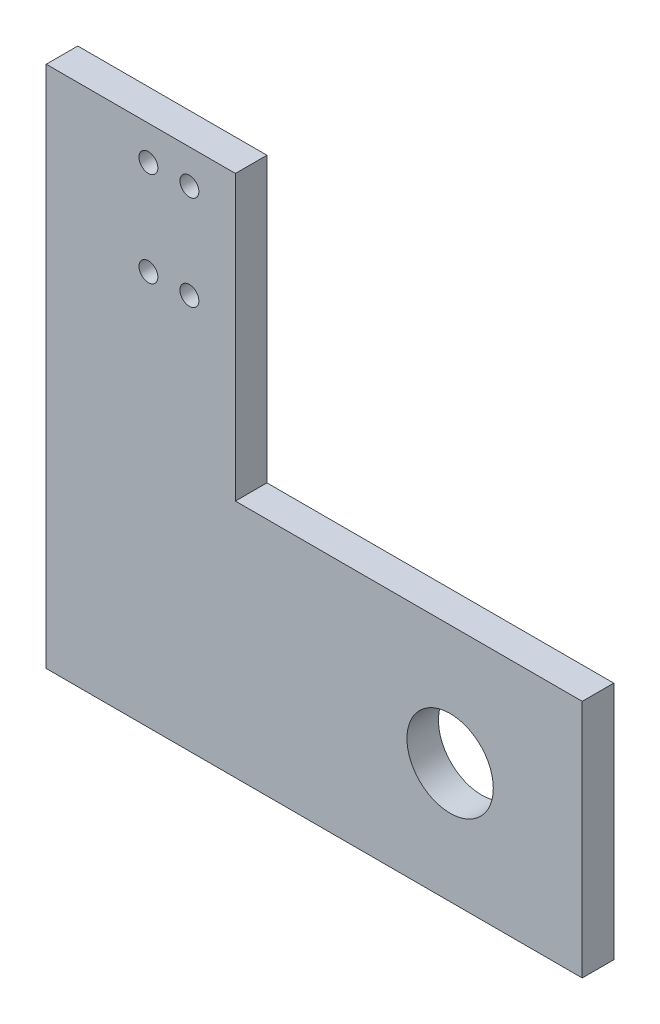
ISO-10303-21;
HEADER;
FILE_DESCRIPTION(('STEP AP214'),'2;1');
FILE_NAME('part.step','',(''),(''),'','','');
FILE_SCHEMA(('AUTOMOTIVE_DESIGN { 1 0 10303 214 1 1 1 1 }'));
ENDSEC;
DATA;
#1=APPLICATION_CONTEXT('core data for automotive mechanical design processes');
#2=APPLICATION_PROTOCOL_DEFINITION('international standard','automotive_design',2000,#1);
#3=PRODUCT_CONTEXT('',#1,'mechanical');
#4=PRODUCT('Part','Part','',(#3));
#5=PRODUCT_RELATED_PRODUCT_CATEGORY('part','',(#4));
#6=PRODUCT_DEFINITION_FORMATION('','',#4);
#7=PRODUCT_DEFINITION_CONTEXT('part definition',#1,'design');
#8=PRODUCT_DEFINITION('design','',#6,#7);
#9=PRODUCT_DEFINITION_SHAPE('','',#8);
#10=(LENGTH_UNIT() NAMED_UNIT(*) SI_UNIT(.MILLI.,.METRE.));
#11=(NAMED_UNIT(*) PLANE_ANGLE_UNIT() SI_UNIT($,.RADIAN.));
#12=(NAMED_UNIT(*) SI_UNIT($,.STERADIAN.) SOLID_ANGLE_UNIT());
#13=UNCERTAINTY_MEASURE_WITH_UNIT(LENGTH_MEASURE(1.E-05),#10,'distance_accuracy_value','');
#14=(GEOMETRIC_REPRESENTATION_CONTEXT(3) GLOBAL_UNCERTAINTY_ASSIGNED_CONTEXT((#13)) GLOBAL_UNIT_ASSIGNED_CONTEXT((#10,
#11,#12)) REPRESENTATION_CONTEXT('',''));
#15=CARTESIAN_POINT('',(0.,0.,0.));
#16=DIRECTION('',(0.,0.,1.));
#17=DIRECTION('',(1.,0.,0.));
#18=AXIS2_PLACEMENT_3D('',#15,#16,#17);
#19=CARTESIAN_POINT('',(0.,0.,5.));
#20=DIRECTION('',(0.,0.,-1.));
#21=DIRECTION('',(-1.,0.,0.));
#22=AXIS2_PLACEMENT_3D('',#19,#20,#21);
#23=PLANE('',#22);
#24=DIRECTION('',(-1.,0.,0.));
#25=VECTOR('',#24,1.);
#26=CARTESIAN_POINT('',(2345.47122728018,4698.97617233095,5.));
#27=LINE('',#26,#25);
#28=CARTESIAN_POINT('',(2400.47122728018,4698.97617233095,5.));
#29=VERTEX_POINT('',#28);
#30=CARTESIAN_POINT('',(2345.47122728018,4698.97617233095,5.));
#31=VERTEX_POINT('',#30);
#32=EDGE_CURVE('E131',#29,#31,#27,.T.);
#33=ORIENTED_EDGE('',*,*,#32,.T.);
#34=DIRECTION('',(0.,1.,0.));
#35=VECTOR('',#34,1.);
#36=CARTESIAN_POINT('',(2345.47122728018,4698.97617233095,5.));
#37=LINE('',#36,#35);
#38=CARTESIAN_POINT('',(2345.47122728018,4743.97617233095,5.));
#39=VERTEX_POINT('',#38);
#40=EDGE_CURVE('E89',#31,#39,#37,.T.);
#41=ORIENTED_EDGE('',*,*,#40,.T.);
#42=DIRECTION('',(-1.,0.,0.));
#43=VECTOR('',#42,1.);
#44=CARTESIAN_POINT('',(2345.47122728018,4743.97617233095,5.));
#45=LINE('',#44,#43);
#46=CARTESIAN_POINT('',(2315.47122728018,4743.97617233095,5.));
#47=VERTEX_POINT('',#46);
#48=EDGE_CURVE('E102',#39,#47,#45,.T.);
#49=ORIENTED_EDGE('',*,*,#48,.T.);
#50=DIRECTION('',(0.,-1.,0.));
#51=VECTOR('',#50,1.);
#52=CARTESIAN_POINT('',(2315.47122728018,4660.97617233095,5.));
#53=LINE('',#52,#51);
#54=CARTESIAN_POINT('',(2315.47122728018,4660.97617233095,5.));
#55=VERTEX_POINT('',#54);
#56=EDGE_CURVE('E96',#47,#55,#53,.T.);
#57=ORIENTED_EDGE('',*,*,#56,.T.);
#58=DIRECTION('',(1.,0.,0.));
#59=VECTOR('',#58,1.);
#60=CARTESIAN_POINT('',(2315.47122728018,4660.97617233095,5.));
#61=LINE('',#60,#59);
#62=CARTESIAN_POINT('',(2400.47122728018,4660.97617233095,5.));
#63=VERTEX_POINT('',#62);
#64=EDGE_CURVE('E100',#55,#63,#61,.T.);
#65=ORIENTED_EDGE('',*,*,#64,.T.);
#66=DIRECTION('',(0.,1.,0.));
#67=VECTOR('',#66,1.);
#68=CARTESIAN_POINT('',(2400.47122728018,4698.97617233095,5.));
#69=LINE('',#68,#67);
#70=EDGE_CURVE('E52',#63,#29,#69,.T.);
#71=ORIENTED_EDGE('',*,*,#70,.T.);
#72=EDGE_LOOP('',(#33,#41,#49,#57,#65,#71));
#73=FACE_BOUND('',#72,.T.);
#74=CARTESIAN_POINT('',(2338.17240907653,4738.57617233095,5.));
#75=DIRECTION('',(0.,0.,1.));
#76=DIRECTION('',(1.,0.,0.));
#77=AXIS2_PLACEMENT_3D('',#74,#75,#76);
#78=CIRCLE('',#77,1.50000000000006);
#79=CARTESIAN_POINT('',(2339.67240907653,4738.57617233095,5.));
#80=VERTEX_POINT('',#79);
#81=EDGE_CURVE('E124',#80,#80,#78,.T.);
#82=ORIENTED_EDGE('',*,*,#81,.F.);
#83=EDGE_LOOP('',(#82));
#84=FACE_BOUND('',#83,.T.);
#85=CARTESIAN_POINT('',(2338.17240907653,4723.57617233095,5.));
#86=DIRECTION('',(0.,0.,1.));
#87=DIRECTION('',(1.,0.,0.));
#88=AXIS2_PLACEMENT_3D('',#85,#86,#87);
#89=CIRCLE('',#88,1.50000000000006);
#90=CARTESIAN_POINT('',(2339.67240907653,4723.57617233095,5.));
#91=VERTEX_POINT('',#90);
#92=EDGE_CURVE('E205',#91,#91,#89,.T.);
#93=ORIENTED_EDGE('',*,*,#92,.F.);
#94=EDGE_LOOP('',(#93));
#95=FACE_BOUND('',#94,.T.);
#96=CARTESIAN_POINT('',(2331.67240907653,4738.57617233095,5.));
#97=DIRECTION('',(0.,0.,1.));
#98=DIRECTION('',(1.,0.,0.));
#99=AXIS2_PLACEMENT_3D('',#96,#97,#98);
#100=CIRCLE('',#99,1.50000000000006);
#101=CARTESIAN_POINT('',(2333.17240907653,4738.57617233095,5.));
#102=VERTEX_POINT('',#101);
#103=EDGE_CURVE('E199',#102,#102,#100,.T.);
#104=ORIENTED_EDGE('',*,*,#103,.F.);
#105=EDGE_LOOP('',(#104));
#106=FACE_BOUND('',#105,.T.);
#107=CARTESIAN_POINT('',(2331.67240907653,4723.57617233095,5.));
#108=DIRECTION('',(0.,0.,1.));
#109=DIRECTION('',(1.,0.,0.));
#110=AXIS2_PLACEMENT_3D('',#107,#108,#109);
#111=CIRCLE('',#110,1.50000000000006);
#112=CARTESIAN_POINT('',(2333.17240907653,4723.57617233095,5.));
#113=VERTEX_POINT('',#112);
#114=EDGE_CURVE('E193',#113,#113,#111,.T.);
#115=ORIENTED_EDGE('',*,*,#114,.F.);
#116=EDGE_LOOP('',(#115));
#117=FACE_BOUND('',#116,.T.);
#118=CARTESIAN_POINT('',(2379.5182473387,4679.97617233095,5.));
#119=DIRECTION('',(0.,0.,1.));
#120=DIRECTION('',(1.,0.,0.));
#121=AXIS2_PLACEMENT_3D('',#118,#119,#120);
#122=CIRCLE('',#121,6.85000000000002);
#123=CARTESIAN_POINT('',(2386.3682473387,4679.97617233095,5.));
#124=VERTEX_POINT('',#123);
#125=EDGE_CURVE('E184',#124,#124,#122,.T.);
#126=ORIENTED_EDGE('',*,*,#125,.F.);
#127=EDGE_LOOP('',(#126));
#128=FACE_BOUND('',#127,.T.);
#129=ADVANCED_FACE('F35',(#73,#84,#95,#106,#117,#128),#23,.F.);
#130=CARTESIAN_POINT('',(0.,0.,0.));
#131=DIRECTION('',(0.,0.,-1.));
#132=DIRECTION('',(-1.,0.,0.));
#133=AXIS2_PLACEMENT_3D('',#130,#131,#132);
#134=PLANE('',#133);
#135=CARTESIAN_POINT('',(2331.67240907653,4723.57617233095,0.));
#136=DIRECTION('',(0.,0.,1.));
#137=DIRECTION('',(1.,0.,0.));
#138=AXIS2_PLACEMENT_3D('',#135,#136,#137);
#139=CIRCLE('',#138,1.50000000000006);
#140=CARTESIAN_POINT('',(2333.17240907653,4723.57617233095,0.));
#141=VERTEX_POINT('',#140);
#142=EDGE_CURVE('E190',#141,#141,#139,.T.);
#143=ORIENTED_EDGE('',*,*,#142,.T.);
#144=EDGE_LOOP('',(#143));
#145=FACE_BOUND('',#144,.T.);
#146=CARTESIAN_POINT('',(2338.17240907653,4723.57617233095,0.));
#147=DIRECTION('',(0.,0.,1.));
#148=DIRECTION('',(1.,0.,0.));
#149=AXIS2_PLACEMENT_3D('',#146,#147,#148);
#150=CIRCLE('',#149,1.50000000000006);
#151=CARTESIAN_POINT('',(2339.67240907653,4723.57617233095,0.));
#152=VERTEX_POINT('',#151);
#153=EDGE_CURVE('E202',#152,#152,#150,.T.);
#154=ORIENTED_EDGE('',*,*,#153,.T.);
#155=EDGE_LOOP('',(#154));
#156=FACE_BOUND('',#155,.T.);
#157=DIRECTION('',(-1.,0.,0.));
#158=VECTOR('',#157,1.);
#159=CARTESIAN_POINT('',(2345.47122728018,4698.97617233095,0.));
#160=LINE('',#159,#158);
#161=CARTESIAN_POINT('',(2400.47122728018,4698.97617233095,0.));
#162=VERTEX_POINT('',#161);
#163=CARTESIAN_POINT('',(2345.47122728018,4698.97617233095,0.));
#164=VERTEX_POINT('',#163);
#165=EDGE_CURVE('E120',#162,#164,#160,.T.);
#166=ORIENTED_EDGE('',*,*,#165,.F.);
#167=DIRECTION('',(0.,1.,0.));
#168=VECTOR('',#167,1.);
#169=CARTESIAN_POINT('',(2400.47122728018,4698.97617233095,0.));
#170=LINE('',#169,#168);
#171=CARTESIAN_POINT('',(2400.47122728018,4660.97617233095,0.));
#172=VERTEX_POINT('',#171);
#173=EDGE_CURVE('E81',#172,#162,#170,.T.);
#174=ORIENTED_EDGE('',*,*,#173,.F.);
#175=DIRECTION('',(1.,0.,0.));
#176=VECTOR('',#175,1.);
#177=CARTESIAN_POINT('',(2315.47122728018,4660.97617233095,0.));
#178=LINE('',#177,#176);
#179=CARTESIAN_POINT('',(2315.47122728018,4660.97617233095,0.));
#180=VERTEX_POINT('',#179);
#181=EDGE_CURVE('E75',#180,#172,#178,.T.);
#182=ORIENTED_EDGE('',*,*,#181,.F.);
#183=DIRECTION('',(0.,-1.,0.));
#184=VECTOR('',#183,1.);
#185=CARTESIAN_POINT('',(2315.47122728018,4660.97617233095,0.));
#186=LINE('',#185,#184);
#187=CARTESIAN_POINT('',(2315.47122728018,4743.97617233095,0.));
#188=VERTEX_POINT('',#187);
#189=EDGE_CURVE('E110',#188,#180,#186,.T.);
#190=ORIENTED_EDGE('',*,*,#189,.F.);
#191=DIRECTION('',(-1.,0.,0.));
#192=VECTOR('',#191,1.);
#193=CARTESIAN_POINT('',(2345.47122728018,4743.97617233095,0.));
#194=LINE('',#193,#192);
#195=CARTESIAN_POINT('',(2345.47122728018,4743.97617233095,0.));
#196=VERTEX_POINT('',#195);
#197=EDGE_CURVE('E126',#196,#188,#194,.T.);
#198=ORIENTED_EDGE('',*,*,#197,.F.);
#199=DIRECTION('',(0.,1.,0.));
#200=VECTOR('',#199,1.);
#201=CARTESIAN_POINT('',(2345.47122728018,4698.97617233095,0.));
#202=LINE('',#201,#200);
#203=EDGE_CURVE('E123',#164,#196,#202,.T.);
#204=ORIENTED_EDGE('',*,*,#203,.F.);
#205=EDGE_LOOP('',(#166,#174,#182,#190,#198,#204));
#206=FACE_BOUND('',#205,.T.);
#207=CARTESIAN_POINT('',(2338.17240907653,4738.57617233095,0.));
#208=DIRECTION('',(0.,0.,1.));
#209=DIRECTION('',(1.,0.,0.));
#210=AXIS2_PLACEMENT_3D('',#207,#208,#209);
#211=CIRCLE('',#210,1.50000000000006);
#212=CARTESIAN_POINT('',(2339.67240907653,4738.57617233095,0.));
#213=VERTEX_POINT('',#212);
#214=EDGE_CURVE('E208',#213,#213,#211,.T.);
#215=ORIENTED_EDGE('',*,*,#214,.T.);
#216=EDGE_LOOP('',(#215));
#217=FACE_BOUND('',#216,.T.);
#218=CARTESIAN_POINT('',(2331.67240907653,4738.57617233095,0.));
#219=DIRECTION('',(0.,0.,1.));
#220=DIRECTION('',(1.,0.,0.));
#221=AXIS2_PLACEMENT_3D('',#218,#219,#220);
#222=CIRCLE('',#221,1.50000000000006);
#223=CARTESIAN_POINT('',(2333.17240907653,4738.57617233095,0.));
#224=VERTEX_POINT('',#223);
#225=EDGE_CURVE('E196',#224,#224,#222,.T.);
#226=ORIENTED_EDGE('',*,*,#225,.T.);
#227=EDGE_LOOP('',(#226));
#228=FACE_BOUND('',#227,.T.);
#229=CARTESIAN_POINT('',(2379.5182473387,4679.97617233095,0.));
#230=DIRECTION('',(0.,0.,1.));
#231=DIRECTION('',(1.,0.,0.));
#232=AXIS2_PLACEMENT_3D('',#229,#230,#231);
#233=CIRCLE('',#232,6.85000000000002);
#234=CARTESIAN_POINT('',(2386.3682473387,4679.97617233095,0.));
#235=VERTEX_POINT('',#234);
#236=EDGE_CURVE('E187',#235,#235,#233,.T.);
#237=ORIENTED_EDGE('',*,*,#236,.T.);
#238=EDGE_LOOP('',(#237));
#239=FACE_BOUND('',#238,.T.);
#240=ADVANCED_FACE('F140',(#145,#156,#206,#217,#228,#239),#134,.T.);
#241=CARTESIAN_POINT('',(2345.47122728018,4698.97617233095,5.));
#242=DIRECTION('',(0.,-1.,0.));
#243=DIRECTION('',(0.,0.,-1.));
#244=AXIS2_PLACEMENT_3D('',#241,#242,#243);
#245=PLANE('',#244);
#246=ORIENTED_EDGE('',*,*,#165,.T.);
#247=DIRECTION('',(0.,0.,-1.));
#248=VECTOR('',#247,1.);
#249=CARTESIAN_POINT('',(2345.47122728018,4698.97617233095,5.));
#250=LINE('',#249,#248);
#251=EDGE_CURVE('E11',#31,#164,#250,.T.);
#252=ORIENTED_EDGE('',*,*,#251,.F.);
#253=ORIENTED_EDGE('',*,*,#32,.F.);
#254=DIRECTION('',(0.,0.,-1.));
#255=VECTOR('',#254,1.);
#256=CARTESIAN_POINT('',(2400.47122728018,4698.97617233095,5.));
#257=LINE('',#256,#255);
#258=EDGE_CURVE('E116',#29,#162,#257,.T.);
#259=ORIENTED_EDGE('',*,*,#258,.T.);
#260=EDGE_LOOP('',(#246,#252,#253,#259));
#261=FACE_BOUND('',#260,.T.);
#262=ADVANCED_FACE('F37',(#261),#245,.F.);
#263=CARTESIAN_POINT('',(2345.47122728018,4698.97617233095,5.));
#264=DIRECTION('',(-1.,0.,0.));
#265=DIRECTION('',(0.,0.,1.));
#266=AXIS2_PLACEMENT_3D('',#263,#264,#265);
#267=PLANE('',#266);
#268=ORIENTED_EDGE('',*,*,#203,.T.);
#269=DIRECTION('',(0.,0.,-1.));
#270=VECTOR('',#269,1.);
#271=CARTESIAN_POINT('',(2345.47122728018,4743.97617233095,5.));
#272=LINE('',#271,#270);
#273=EDGE_CURVE('E44',#39,#196,#272,.T.);
#274=ORIENTED_EDGE('',*,*,#273,.F.);
#275=ORIENTED_EDGE('',*,*,#40,.F.);
#276=ORIENTED_EDGE('',*,*,#251,.T.);
#277=EDGE_LOOP('',(#268,#274,#275,#276));
#278=FACE_BOUND('',#277,.T.);
#279=ADVANCED_FACE('F277',(#278),#267,.F.);
#280=CARTESIAN_POINT('',(2345.47122728018,4743.97617233095,5.));
#281=DIRECTION('',(0.,-1.,0.));
#282=DIRECTION('',(0.,0.,-1.));
#283=AXIS2_PLACEMENT_3D('',#280,#281,#282);
#284=PLANE('',#283);
#285=ORIENTED_EDGE('',*,*,#197,.T.);
#286=DIRECTION('',(0.,0.,-1.));
#287=VECTOR('',#286,1.);
#288=CARTESIAN_POINT('',(2315.47122728018,4743.97617233095,5.));
#289=LINE('',#288,#287);
#290=EDGE_CURVE('E111',#47,#188,#289,.T.);
#291=ORIENTED_EDGE('',*,*,#290,.F.);
#292=ORIENTED_EDGE('',*,*,#48,.F.);
#293=ORIENTED_EDGE('',*,*,#273,.T.);
#294=EDGE_LOOP('',(#285,#291,#292,#293));
#295=FACE_BOUND('',#294,.T.);
#296=ADVANCED_FACE('F137',(#295),#284,.F.);
#297=CARTESIAN_POINT('',(2315.47122728018,4660.97617233095,5.));
#298=DIRECTION('',(1.,0.,0.));
#299=DIRECTION('',(0.,0.,-1.));
#300=AXIS2_PLACEMENT_3D('',#297,#298,#299);
#301=PLANE('',#300);
#302=ORIENTED_EDGE('',*,*,#189,.T.);
#303=DIRECTION('',(0.,0.,-1.));
#304=VECTOR('',#303,1.);
#305=CARTESIAN_POINT('',(2315.47122728018,4660.97617233095,5.));
#306=LINE('',#305,#304);
#307=EDGE_CURVE('E107',#55,#180,#306,.T.);
#308=ORIENTED_EDGE('',*,*,#307,.F.);
#309=ORIENTED_EDGE('',*,*,#56,.F.);
#310=ORIENTED_EDGE('',*,*,#290,.T.);
#311=EDGE_LOOP('',(#302,#308,#309,#310));
#312=FACE_BOUND('',#311,.T.);
#313=ADVANCED_FACE('F108',(#312),#301,.F.);
#314=CARTESIAN_POINT('',(2315.47122728018,4660.97617233095,5.));
#315=DIRECTION('',(0.,1.,0.));
#316=DIRECTION('',(0.,0.,1.));
#317=AXIS2_PLACEMENT_3D('',#314,#315,#316);
#318=PLANE('',#317);
#319=ORIENTED_EDGE('',*,*,#181,.T.);
#320=DIRECTION('',(0.,0.,-1.));
#321=VECTOR('',#320,1.);
#322=CARTESIAN_POINT('',(2400.47122728018,4660.97617233095,5.));
#323=LINE('',#322,#321);
#324=EDGE_CURVE('E112',#63,#172,#323,.T.);
#325=ORIENTED_EDGE('',*,*,#324,.F.);
#326=ORIENTED_EDGE('',*,*,#64,.F.);
#327=ORIENTED_EDGE('',*,*,#307,.T.);
#328=EDGE_LOOP('',(#319,#325,#326,#327));
#329=FACE_BOUND('',#328,.T.);
#330=ADVANCED_FACE('F114',(#329),#318,.F.);
#331=CARTESIAN_POINT('',(2400.47122728018,4698.97617233095,5.));
#332=DIRECTION('',(-1.,0.,0.));
#333=DIRECTION('',(0.,-1.,0.));
#334=AXIS2_PLACEMENT_3D('',#331,#332,#333);
#335=PLANE('',#334);
#336=ORIENTED_EDGE('',*,*,#173,.T.);
#337=ORIENTED_EDGE('',*,*,#258,.F.);
#338=ORIENTED_EDGE('',*,*,#70,.F.);
#339=ORIENTED_EDGE('',*,*,#324,.T.);
#340=EDGE_LOOP('',(#336,#337,#338,#339));
#341=FACE_BOUND('',#340,.T.);
#342=ADVANCED_FACE('F145',(#341),#335,.F.);
#343=CARTESIAN_POINT('',(2338.17240907653,4738.57617233095,5.));
#344=DIRECTION('',(0.,0.,-1.));
#345=DIRECTION('',(-1.,0.,0.));
#346=AXIS2_PLACEMENT_3D('',#343,#344,#345);
#347=CYLINDRICAL_SURFACE('',#346,1.50000000000006);
#348=ORIENTED_EDGE('',*,*,#81,.T.);
#349=EDGE_LOOP('',(#348));
#350=FACE_BOUND('',#349,.T.);
#351=ORIENTED_EDGE('',*,*,#214,.F.);
#352=EDGE_LOOP('',(#351));
#353=FACE_BOUND('',#352,.T.);
#354=ADVANCED_FACE('F147',(#350,#353),#347,.F.);
#355=CARTESIAN_POINT('',(2338.17240907653,4723.57617233095,5.));
#356=DIRECTION('',(0.,0.,-1.));
#357=DIRECTION('',(-1.,0.,0.));
#358=AXIS2_PLACEMENT_3D('',#355,#356,#357);
#359=CYLINDRICAL_SURFACE('',#358,1.50000000000006);
#360=ORIENTED_EDGE('',*,*,#92,.T.);
#361=EDGE_LOOP('',(#360));
#362=FACE_BOUND('',#361,.T.);
#363=ORIENTED_EDGE('',*,*,#153,.F.);
#364=EDGE_LOOP('',(#363));
#365=FACE_BOUND('',#364,.T.);
#366=ADVANCED_FACE('F153',(#362,#365),#359,.F.);
#367=CARTESIAN_POINT('',(2331.67240907653,4738.57617233095,5.));
#368=DIRECTION('',(0.,0.,-1.));
#369=DIRECTION('',(-1.,0.,0.));
#370=AXIS2_PLACEMENT_3D('',#367,#368,#369);
#371=CYLINDRICAL_SURFACE('',#370,1.50000000000006);
#372=ORIENTED_EDGE('',*,*,#103,.T.);
#373=EDGE_LOOP('',(#372));
#374=FACE_BOUND('',#373,.T.);
#375=ORIENTED_EDGE('',*,*,#225,.F.);
#376=EDGE_LOOP('',(#375));
#377=FACE_BOUND('',#376,.T.);
#378=ADVANCED_FACE('F167',(#374,#377),#371,.F.);
#379=CARTESIAN_POINT('',(2331.67240907653,4723.57617233095,5.));
#380=DIRECTION('',(0.,0.,-1.));
#381=DIRECTION('',(-1.,0.,0.));
#382=AXIS2_PLACEMENT_3D('',#379,#380,#381);
#383=CYLINDRICAL_SURFACE('',#382,1.50000000000006);
#384=ORIENTED_EDGE('',*,*,#114,.T.);
#385=EDGE_LOOP('',(#384));
#386=FACE_BOUND('',#385,.T.);
#387=ORIENTED_EDGE('',*,*,#142,.F.);
#388=EDGE_LOOP('',(#387));
#389=FACE_BOUND('',#388,.T.);
#390=ADVANCED_FACE('F171',(#386,#389),#383,.F.);
#391=CARTESIAN_POINT('',(2379.5182473387,4679.97617233095,5.));
#392=DIRECTION('',(0.,0.,-1.));
#393=DIRECTION('',(-1.,0.,0.));
#394=AXIS2_PLACEMENT_3D('',#391,#392,#393);
#395=CYLINDRICAL_SURFACE('',#394,6.85000000000002);
#396=ORIENTED_EDGE('',*,*,#125,.T.);
#397=EDGE_LOOP('',(#396));
#398=FACE_BOUND('',#397,.T.);
#399=ORIENTED_EDGE('',*,*,#236,.F.);
#400=EDGE_LOOP('',(#399));
#401=FACE_BOUND('',#400,.T.);
#402=ADVANCED_FACE('F175',(#398,#401),#395,.F.);
#403=CLOSED_SHELL('',(#129,#240,#262,#279,#296,#313,#330,#342,#354,#366,#378,#390,#402));
#404=MANIFOLD_SOLID_BREP('B2',#403);
#405=ADVANCED_BREP_SHAPE_REPRESENTATION('',(#18,#404),#14);
#406=SHAPE_DEFINITION_REPRESENTATION(#9,#405);
ENDSEC;
END-ISO-10303-21;
